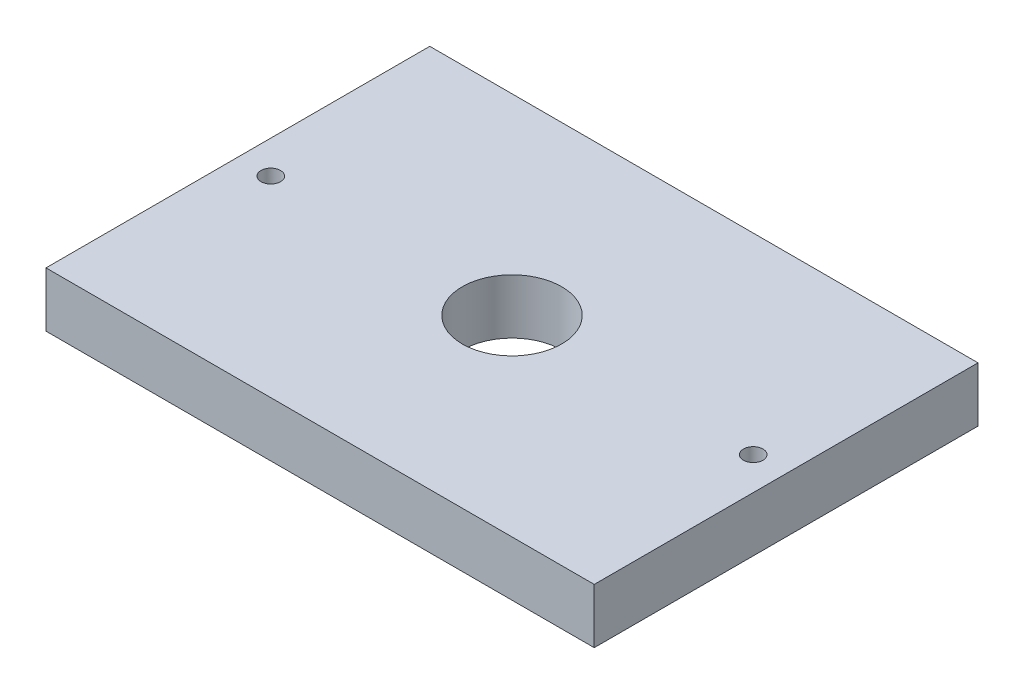
ISO-10303-21;
HEADER;
FILE_DESCRIPTION(('STEP AP214'),'2;1');
FILE_NAME('part.step','',(''),(''),'','','');
FILE_SCHEMA(('AUTOMOTIVE_DESIGN { 1 0 10303 214 1 1 1 1 }'));
ENDSEC;
DATA;
#1=APPLICATION_CONTEXT('core data for automotive mechanical design processes');
#2=APPLICATION_PROTOCOL_DEFINITION('international standard','automotive_design',2000,#1);
#3=PRODUCT_CONTEXT('',#1,'mechanical');
#4=PRODUCT('Part','Part','',(#3));
#5=PRODUCT_RELATED_PRODUCT_CATEGORY('part','',(#4));
#6=PRODUCT_DEFINITION_FORMATION('','',#4);
#7=PRODUCT_DEFINITION_CONTEXT('part definition',#1,'design');
#8=PRODUCT_DEFINITION('design','',#6,#7);
#9=PRODUCT_DEFINITION_SHAPE('','',#8);
#10=(LENGTH_UNIT() NAMED_UNIT(*) SI_UNIT(.MILLI.,.METRE.));
#11=(NAMED_UNIT(*) PLANE_ANGLE_UNIT() SI_UNIT($,.RADIAN.));
#12=(NAMED_UNIT(*) SI_UNIT($,.STERADIAN.) SOLID_ANGLE_UNIT());
#13=UNCERTAINTY_MEASURE_WITH_UNIT(LENGTH_MEASURE(1.E-05),#10,'distance_accuracy_value','');
#14=(GEOMETRIC_REPRESENTATION_CONTEXT(3) GLOBAL_UNCERTAINTY_ASSIGNED_CONTEXT((#13)) GLOBAL_UNIT_ASSIGNED_CONTEXT((#10,
#11,#12)) REPRESENTATION_CONTEXT('',''));
#15=CARTESIAN_POINT('',(0.,0.,0.));
#16=DIRECTION('',(0.,0.,1.));
#17=DIRECTION('',(1.,0.,0.));
#18=AXIS2_PLACEMENT_3D('',#15,#16,#17);
#19=CARTESIAN_POINT('',(-26.9974057296198,6.35,-3.26084320228637));
#20=DIRECTION('',(1.,0.,0.));
#21=DIRECTION('',(0.,0.,-1.));
#22=AXIS2_PLACEMENT_3D('',#19,#20,#21);
#23=PLANE('',#22);
#24=DIRECTION('',(0.,0.,1.));
#25=VECTOR('',#24,1.);
#26=CARTESIAN_POINT('',(-26.9974057296198,0.,-3.26084320228637));
#27=LINE('',#26,#25);
#28=CARTESIAN_POINT('',(-26.9974057296198,0.,-3.26084320228637));
#29=VERTEX_POINT('',#28);
#30=CARTESIAN_POINT('',(-26.9974057296198,0.,41.1891567977136));
#31=VERTEX_POINT('',#30);
#32=EDGE_CURVE('E94',#29,#31,#27,.T.);
#33=ORIENTED_EDGE('',*,*,#32,.T.);
#34=DIRECTION('',(0.,-1.,0.));
#35=VECTOR('',#34,1.);
#36=CARTESIAN_POINT('',(-26.9974057296198,6.35,41.1891567977136));
#37=LINE('',#36,#35);
#38=CARTESIAN_POINT('',(-26.9974057296198,6.35,41.1891567977136));
#39=VERTEX_POINT('',#38);
#40=EDGE_CURVE('E11',#39,#31,#37,.T.);
#41=ORIENTED_EDGE('',*,*,#40,.F.);
#42=DIRECTION('',(0.,0.,1.));
#43=VECTOR('',#42,1.);
#44=CARTESIAN_POINT('',(-26.9974057296198,6.35,-3.26084320228637));
#45=LINE('',#44,#43);
#46=CARTESIAN_POINT('',(-26.9974057296198,6.35,-3.26084320228637));
#47=VERTEX_POINT('',#46);
#48=EDGE_CURVE('E82',#47,#39,#45,.T.);
#49=ORIENTED_EDGE('',*,*,#48,.F.);
#50=DIRECTION('',(0.,-1.,0.));
#51=VECTOR('',#50,1.);
#52=CARTESIAN_POINT('',(-26.9974057296198,6.35,-3.26084320228637));
#53=LINE('',#52,#51);
#54=EDGE_CURVE('E90',#47,#29,#53,.T.);
#55=ORIENTED_EDGE('',*,*,#54,.T.);
#56=EDGE_LOOP('',(#33,#41,#49,#55));
#57=FACE_BOUND('',#56,.T.);
#58=ADVANCED_FACE('F31',(#57),#23,.F.);
#59=CARTESIAN_POINT('',(-26.9974057296198,6.35,41.1891567977136));
#60=DIRECTION('',(0.,0.,-1.));
#61=DIRECTION('',(-1.,0.,0.));
#62=AXIS2_PLACEMENT_3D('',#59,#60,#61);
#63=PLANE('',#62);
#64=DIRECTION('',(1.,0.,0.));
#65=VECTOR('',#64,1.);
#66=CARTESIAN_POINT('',(-26.9974057296198,0.,41.1891567977136));
#67=LINE('',#66,#65);
#68=CARTESIAN_POINT('',(36.5025942703802,0.,41.1891567977136));
#69=VERTEX_POINT('',#68);
#70=EDGE_CURVE('E86',#31,#69,#67,.T.);
#71=ORIENTED_EDGE('',*,*,#70,.T.);
#72=DIRECTION('',(0.,-1.,0.));
#73=VECTOR('',#72,1.);
#74=CARTESIAN_POINT('',(36.5025942703802,6.35,41.1891567977136));
#75=LINE('',#74,#73);
#76=CARTESIAN_POINT('',(36.5025942703802,6.35,41.1891567977136));
#77=VERTEX_POINT('',#76);
#78=EDGE_CURVE('E39',#77,#69,#75,.T.);
#79=ORIENTED_EDGE('',*,*,#78,.F.);
#80=DIRECTION('',(1.,0.,0.));
#81=VECTOR('',#80,1.);
#82=CARTESIAN_POINT('',(-26.9974057296198,6.35,41.1891567977136));
#83=LINE('',#82,#81);
#84=EDGE_CURVE('E77',#39,#77,#83,.T.);
#85=ORIENTED_EDGE('',*,*,#84,.F.);
#86=ORIENTED_EDGE('',*,*,#40,.T.);
#87=EDGE_LOOP('',(#71,#79,#85,#86));
#88=FACE_BOUND('',#87,.T.);
#89=ADVANCED_FACE('F85',(#88),#63,.F.);
#90=CARTESIAN_POINT('',(36.5025942703802,6.35,-3.26084320228637));
#91=DIRECTION('',(-1.,0.,0.));
#92=DIRECTION('',(0.,0.,1.));
#93=AXIS2_PLACEMENT_3D('',#90,#91,#92);
#94=PLANE('',#93);
#95=DIRECTION('',(0.,0.,-1.));
#96=VECTOR('',#95,1.);
#97=CARTESIAN_POINT('',(36.5025942703802,0.,-3.26084320228637));
#98=LINE('',#97,#96);
#99=CARTESIAN_POINT('',(36.5025942703802,0.,-3.26084320228637));
#100=VERTEX_POINT('',#99);
#101=EDGE_CURVE('E64',#69,#100,#98,.T.);
#102=ORIENTED_EDGE('',*,*,#101,.T.);
#103=DIRECTION('',(0.,-1.,0.));
#104=VECTOR('',#103,1.);
#105=CARTESIAN_POINT('',(36.5025942703802,6.35,-3.26084320228637));
#106=LINE('',#105,#104);
#107=CARTESIAN_POINT('',(36.5025942703802,6.35,-3.26084320228637));
#108=VERTEX_POINT('',#107);
#109=EDGE_CURVE('E87',#108,#100,#106,.T.);
#110=ORIENTED_EDGE('',*,*,#109,.F.);
#111=DIRECTION('',(0.,0.,-1.));
#112=VECTOR('',#111,1.);
#113=CARTESIAN_POINT('',(36.5025942703802,6.35,-3.26084320228637));
#114=LINE('',#113,#112);
#115=EDGE_CURVE('E80',#77,#108,#114,.T.);
#116=ORIENTED_EDGE('',*,*,#115,.F.);
#117=ORIENTED_EDGE('',*,*,#78,.T.);
#118=EDGE_LOOP('',(#102,#110,#116,#117));
#119=FACE_BOUND('',#118,.T.);
#120=ADVANCED_FACE('F88',(#119),#94,.F.);
#121=CARTESIAN_POINT('',(-26.9974057296198,6.35,-3.26084320228637));
#122=DIRECTION('',(0.,0.,1.));
#123=DIRECTION('',(1.,0.,0.));
#124=AXIS2_PLACEMENT_3D('',#121,#122,#123);
#125=PLANE('',#124);
#126=DIRECTION('',(-1.,0.,0.));
#127=VECTOR('',#126,1.);
#128=CARTESIAN_POINT('',(-26.9974057296198,0.,-3.26084320228637));
#129=LINE('',#128,#127);
#130=EDGE_CURVE('E70',#100,#29,#129,.T.);
#131=ORIENTED_EDGE('',*,*,#130,.T.);
#132=ORIENTED_EDGE('',*,*,#54,.F.);
#133=DIRECTION('',(-1.,0.,0.));
#134=VECTOR('',#133,1.);
#135=CARTESIAN_POINT('',(-26.9974057296198,6.35,-3.26084320228637));
#136=LINE('',#135,#134);
#137=EDGE_CURVE('E47',#108,#47,#136,.T.);
#138=ORIENTED_EDGE('',*,*,#137,.F.);
#139=ORIENTED_EDGE('',*,*,#109,.T.);
#140=EDGE_LOOP('',(#131,#132,#138,#139));
#141=FACE_BOUND('',#140,.T.);
#142=ADVANCED_FACE('F102',(#141),#125,.F.);
#143=CARTESIAN_POINT('',(-26.9974057296198,6.35,41.1891567977136));
#144=DIRECTION('',(0.,1.,0.));
#145=DIRECTION('',(0.,0.,1.));
#146=AXIS2_PLACEMENT_3D('',#143,#144,#145);
#147=PLANE('',#146);
#148=CARTESIAN_POINT('',(4.75259427038018,6.35,18.9641567977136));
#149=DIRECTION('',(0.,1.,0.));
#150=DIRECTION('',(0.,0.,1.));
#151=AXIS2_PLACEMENT_3D('',#148,#149,#150);
#152=CIRCLE('',#151,5.75437);
#153=CARTESIAN_POINT('',(4.75259427038018,6.35,24.7185267977136));
#154=VERTEX_POINT('',#153);
#155=EDGE_CURVE('E122',#154,#154,#152,.T.);
#156=ORIENTED_EDGE('',*,*,#155,.F.);
#157=EDGE_LOOP('',(#156));
#158=FACE_BOUND('',#157,.T.);
#159=CARTESIAN_POINT('',(32.6925942703802,6.35,18.9641567977136));
#160=DIRECTION('',(0.,1.,0.));
#161=DIRECTION('',(0.,0.,1.));
#162=AXIS2_PLACEMENT_3D('',#159,#160,#161);
#163=CIRCLE('',#162,1.1303);
#164=CARTESIAN_POINT('',(32.6925942703802,6.35,20.0944567977136));
#165=VERTEX_POINT('',#164);
#166=EDGE_CURVE('E116',#165,#165,#163,.T.);
#167=ORIENTED_EDGE('',*,*,#166,.F.);
#168=EDGE_LOOP('',(#167));
#169=FACE_BOUND('',#168,.T.);
#170=CARTESIAN_POINT('',(-23.1874057296198,6.35,18.9641567977136));
#171=DIRECTION('',(0.,1.,0.));
#172=DIRECTION('',(0.,0.,1.));
#173=AXIS2_PLACEMENT_3D('',#170,#171,#172);
#174=CIRCLE('',#173,1.1303);
#175=CARTESIAN_POINT('',(-23.1874057296198,6.35,20.0944567977136));
#176=VERTEX_POINT('',#175);
#177=EDGE_CURVE('E97',#176,#176,#174,.T.);
#178=ORIENTED_EDGE('',*,*,#177,.F.);
#179=EDGE_LOOP('',(#178));
#180=FACE_BOUND('',#179,.T.);
#181=ORIENTED_EDGE('',*,*,#48,.T.);
#182=ORIENTED_EDGE('',*,*,#84,.T.);
#183=ORIENTED_EDGE('',*,*,#115,.T.);
#184=ORIENTED_EDGE('',*,*,#137,.T.);
#185=EDGE_LOOP('',(#181,#182,#183,#184));
#186=FACE_BOUND('',#185,.T.);
#187=ADVANCED_FACE('F78',(#158,#169,#180,#186),#147,.T.);
#188=CARTESIAN_POINT('',(-26.9974057296198,0.,41.1891567977136));
#189=DIRECTION('',(0.,1.,0.));
#190=DIRECTION('',(0.,0.,1.));
#191=AXIS2_PLACEMENT_3D('',#188,#189,#190);
#192=PLANE('',#191);
#193=CARTESIAN_POINT('',(4.75259427038018,0.,18.9641567977136));
#194=DIRECTION('',(0.,1.,0.));
#195=DIRECTION('',(0.,0.,1.));
#196=AXIS2_PLACEMENT_3D('',#193,#194,#195);
#197=CIRCLE('',#196,5.75437);
#198=CARTESIAN_POINT('',(4.75259427038018,0.,24.7185267977136));
#199=VERTEX_POINT('',#198);
#200=EDGE_CURVE('E119',#199,#199,#197,.T.);
#201=ORIENTED_EDGE('',*,*,#200,.T.);
#202=EDGE_LOOP('',(#201));
#203=FACE_BOUND('',#202,.T.);
#204=CARTESIAN_POINT('',(32.6925942703802,0.,18.9641567977136));
#205=DIRECTION('',(0.,-1.,0.));
#206=DIRECTION('',(0.,0.,-1.));
#207=AXIS2_PLACEMENT_3D('',#204,#205,#206);
#208=CIRCLE('',#207,1.1303);
#209=CARTESIAN_POINT('',(32.6925942703802,0.,17.8338567977136));
#210=VERTEX_POINT('',#209);
#211=EDGE_CURVE('E113',#210,#210,#208,.T.);
#212=ORIENTED_EDGE('',*,*,#211,.F.);
#213=EDGE_LOOP('',(#212));
#214=FACE_BOUND('',#213,.T.);
#215=CARTESIAN_POINT('',(-23.1874057296198,0.,18.9641567977136));
#216=DIRECTION('',(0.,-1.,0.));
#217=DIRECTION('',(0.,0.,-1.));
#218=AXIS2_PLACEMENT_3D('',#215,#216,#217);
#219=CIRCLE('',#218,1.1303);
#220=CARTESIAN_POINT('',(-23.1874057296198,0.,17.8338567977136));
#221=VERTEX_POINT('',#220);
#222=EDGE_CURVE('E110',#221,#221,#219,.T.);
#223=ORIENTED_EDGE('',*,*,#222,.F.);
#224=EDGE_LOOP('',(#223));
#225=FACE_BOUND('',#224,.T.);
#226=ORIENTED_EDGE('',*,*,#32,.F.);
#227=ORIENTED_EDGE('',*,*,#130,.F.);
#228=ORIENTED_EDGE('',*,*,#101,.F.);
#229=ORIENTED_EDGE('',*,*,#70,.F.);
#230=EDGE_LOOP('',(#226,#227,#228,#229));
#231=FACE_BOUND('',#230,.T.);
#232=ADVANCED_FACE('F105',(#203,#214,#225,#231),#192,.F.);
#233=CARTESIAN_POINT('',(-23.1874057296198,0.,18.9641567977136));
#234=DIRECTION('',(0.,-1.,0.));
#235=DIRECTION('',(0.,0.,-1.));
#236=AXIS2_PLACEMENT_3D('',#233,#234,#235);
#237=CYLINDRICAL_SURFACE('',#236,1.1303);
#238=ORIENTED_EDGE('',*,*,#177,.T.);
#239=EDGE_LOOP('',(#238));
#240=FACE_BOUND('',#239,.T.);
#241=ORIENTED_EDGE('',*,*,#222,.T.);
#242=EDGE_LOOP('',(#241));
#243=FACE_BOUND('',#242,.T.);
#244=ADVANCED_FACE('F135',(#240,#243),#237,.F.);
#245=CARTESIAN_POINT('',(32.6925942703802,0.,18.9641567977136));
#246=DIRECTION('',(0.,-1.,0.));
#247=DIRECTION('',(0.,0.,-1.));
#248=AXIS2_PLACEMENT_3D('',#245,#246,#247);
#249=CYLINDRICAL_SURFACE('',#248,1.1303);
#250=ORIENTED_EDGE('',*,*,#166,.T.);
#251=EDGE_LOOP('',(#250));
#252=FACE_BOUND('',#251,.T.);
#253=ORIENTED_EDGE('',*,*,#211,.T.);
#254=EDGE_LOOP('',(#253));
#255=FACE_BOUND('',#254,.T.);
#256=ADVANCED_FACE('F138',(#252,#255),#249,.F.);
#257=CARTESIAN_POINT('',(4.75259427038018,6.35,18.9641567977136));
#258=DIRECTION('',(0.,1.,0.));
#259=DIRECTION('',(0.,0.,1.));
#260=AXIS2_PLACEMENT_3D('',#257,#258,#259);
#261=CYLINDRICAL_SURFACE('',#260,5.75437);
#262=ORIENTED_EDGE('',*,*,#200,.F.);
#263=EDGE_LOOP('',(#262));
#264=FACE_BOUND('',#263,.T.);
#265=ORIENTED_EDGE('',*,*,#155,.T.);
#266=EDGE_LOOP('',(#265));
#267=FACE_BOUND('',#266,.T.);
#268=ADVANCED_FACE('F126',(#264,#267),#261,.F.);
#269=CLOSED_SHELL('',(#58,#89,#120,#142,#187,#232,#244,#256,#268));
#270=MANIFOLD_SOLID_BREP('B2',#269);
#271=ADVANCED_BREP_SHAPE_REPRESENTATION('',(#18,#270),#14);
#272=SHAPE_DEFINITION_REPRESENTATION(#9,#271);
ENDSEC;
END-ISO-10303-21;
